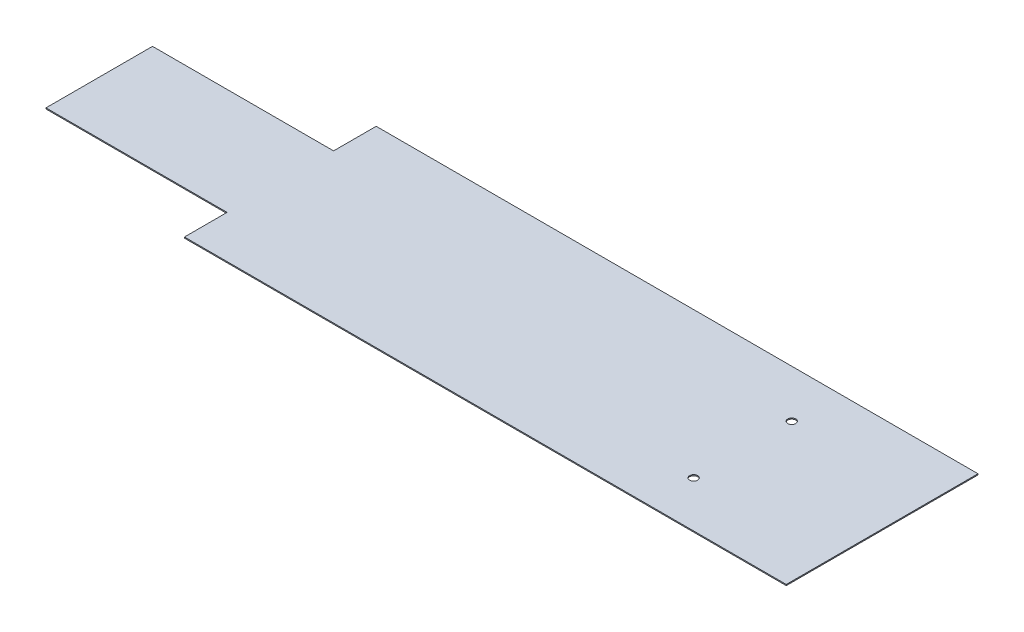
ISO-10303-21;
HEADER;
FILE_DESCRIPTION(('STEP AP214'),'2;1');
FILE_NAME('part.step','',(''),(''),'','','');
FILE_SCHEMA(('AUTOMOTIVE_DESIGN { 1 0 10303 214 1 1 1 1 }'));
ENDSEC;
DATA;
#1=APPLICATION_CONTEXT('core data for automotive mechanical design processes');
#2=APPLICATION_PROTOCOL_DEFINITION('international standard','automotive_design',2000,#1);
#3=PRODUCT_CONTEXT('',#1,'mechanical');
#4=PRODUCT('Part','Part','',(#3));
#5=PRODUCT_RELATED_PRODUCT_CATEGORY('part','',(#4));
#6=PRODUCT_DEFINITION_FORMATION('','',#4);
#7=PRODUCT_DEFINITION_CONTEXT('part definition',#1,'design');
#8=PRODUCT_DEFINITION('design','',#6,#7);
#9=PRODUCT_DEFINITION_SHAPE('','',#8);
#10=(LENGTH_UNIT() NAMED_UNIT(*) SI_UNIT(.MILLI.,.METRE.));
#11=(NAMED_UNIT(*) PLANE_ANGLE_UNIT() SI_UNIT($,.RADIAN.));
#12=(NAMED_UNIT(*) SI_UNIT($,.STERADIAN.) SOLID_ANGLE_UNIT());
#13=UNCERTAINTY_MEASURE_WITH_UNIT(LENGTH_MEASURE(1.E-05),#10,'distance_accuracy_value','');
#14=(GEOMETRIC_REPRESENTATION_CONTEXT(3) GLOBAL_UNCERTAINTY_ASSIGNED_CONTEXT((#13)) GLOBAL_UNIT_ASSIGNED_CONTEXT((#10,
#11,#12)) REPRESENTATION_CONTEXT('',''));
#15=CARTESIAN_POINT('',(0.,0.,0.));
#16=DIRECTION('',(0.,0.,1.));
#17=DIRECTION('',(1.,0.,0.));
#18=AXIS2_PLACEMENT_3D('',#15,#16,#17);
#19=CARTESIAN_POINT('',(377.059739774095,2.,-216.784759358289));
#20=DIRECTION('',(-1.,0.,0.));
#21=DIRECTION('',(0.,0.,1.));
#22=AXIS2_PLACEMENT_3D('',#19,#20,#21);
#23=PLANE('',#22);
#24=DIRECTION('',(0.,0.,-1.));
#25=VECTOR('',#24,1.);
#26=CARTESIAN_POINT('',(377.059739774095,0.,-216.784759358289));
#27=LINE('',#26,#25);
#28=CARTESIAN_POINT('',(377.059739774095,0.,143.215240641711));
#29=VERTEX_POINT('',#28);
#30=CARTESIAN_POINT('',(377.059739774095,0.,-216.784759358289));
#31=VERTEX_POINT('',#30);
#32=EDGE_CURVE('E140',#29,#31,#27,.T.);
#33=ORIENTED_EDGE('',*,*,#32,.T.);
#34=DIRECTION('',(0.,-1.,0.));
#35=VECTOR('',#34,1.);
#36=CARTESIAN_POINT('',(377.059739774095,2.,-216.784759358289));
#37=LINE('',#36,#35);
#38=CARTESIAN_POINT('',(377.059739774095,2.,-216.784759358289));
#39=VERTEX_POINT('',#38);
#40=EDGE_CURVE('E11',#39,#31,#37,.T.);
#41=ORIENTED_EDGE('',*,*,#40,.F.);
#42=DIRECTION('',(0.,0.,-1.));
#43=VECTOR('',#42,1.);
#44=CARTESIAN_POINT('',(377.059739774095,2.,-216.784759358289));
#45=LINE('',#44,#43);
#46=CARTESIAN_POINT('',(377.059739774095,2.,143.215240641711));
#47=VERTEX_POINT('',#46);
#48=EDGE_CURVE('E163',#47,#39,#45,.T.);
#49=ORIENTED_EDGE('',*,*,#48,.F.);
#50=DIRECTION('',(0.,-1.,0.));
#51=VECTOR('',#50,1.);
#52=CARTESIAN_POINT('',(377.059739774095,2.,143.215240641711));
#53=LINE('',#52,#51);
#54=EDGE_CURVE('E136',#47,#29,#53,.T.);
#55=ORIENTED_EDGE('',*,*,#54,.T.);
#56=EDGE_LOOP('',(#33,#41,#49,#55));
#57=FACE_BOUND('',#56,.T.);
#58=ADVANCED_FACE('F39',(#57),#23,.F.);
#59=CARTESIAN_POINT('',(377.059739774095,2.,-216.784759358289));
#60=DIRECTION('',(0.,0.,1.));
#61=DIRECTION('',(1.,0.,0.));
#62=AXIS2_PLACEMENT_3D('',#59,#60,#61);
#63=PLANE('',#62);
#64=DIRECTION('',(-1.,0.,0.));
#65=VECTOR('',#64,1.);
#66=CARTESIAN_POINT('',(377.059739774095,0.,-216.784759358289));
#67=LINE('',#66,#65);
#68=CARTESIAN_POINT('',(-752.940260225905,0.,-216.784759358289));
#69=VERTEX_POINT('',#68);
#70=EDGE_CURVE('E144',#31,#69,#67,.T.);
#71=ORIENTED_EDGE('',*,*,#70,.T.);
#72=DIRECTION('',(0.,-1.,0.));
#73=VECTOR('',#72,1.);
#74=CARTESIAN_POINT('',(-752.940260225905,2.,-216.784759358289));
#75=LINE('',#74,#73);
#76=CARTESIAN_POINT('',(-752.940260225905,2.,-216.784759358289));
#77=VERTEX_POINT('',#76);
#78=EDGE_CURVE('E48',#77,#69,#75,.T.);
#79=ORIENTED_EDGE('',*,*,#78,.F.);
#80=DIRECTION('',(-1.,0.,0.));
#81=VECTOR('',#80,1.);
#82=CARTESIAN_POINT('',(377.059739774095,2.,-216.784759358289));
#83=LINE('',#82,#81);
#84=EDGE_CURVE('E99',#39,#77,#83,.T.);
#85=ORIENTED_EDGE('',*,*,#84,.F.);
#86=ORIENTED_EDGE('',*,*,#40,.T.);
#87=EDGE_LOOP('',(#71,#79,#85,#86));
#88=FACE_BOUND('',#87,.T.);
#89=ADVANCED_FACE('F247',(#88),#63,.F.);
#90=CARTESIAN_POINT('',(-752.940260225905,2.,-216.784759358289));
#91=DIRECTION('',(1.,0.,0.));
#92=DIRECTION('',(0.,0.,-1.));
#93=AXIS2_PLACEMENT_3D('',#90,#91,#92);
#94=PLANE('',#93);
#95=DIRECTION('',(0.,0.,1.));
#96=VECTOR('',#95,1.);
#97=CARTESIAN_POINT('',(-752.940260225905,0.,-216.784759358289));
#98=LINE('',#97,#96);
#99=CARTESIAN_POINT('',(-752.940260225905,0.,-136.784759358289));
#100=VERTEX_POINT('',#99);
#101=EDGE_CURVE('E148',#69,#100,#98,.T.);
#102=ORIENTED_EDGE('',*,*,#101,.T.);
#103=DIRECTION('',(0.,-1.,0.));
#104=VECTOR('',#103,1.);
#105=CARTESIAN_POINT('',(-752.940260225905,2.,-136.784759358289));
#106=LINE('',#105,#104);
#107=CARTESIAN_POINT('',(-752.940260225905,2.,-136.784759358289));
#108=VERTEX_POINT('',#107);
#109=EDGE_CURVE('E174',#108,#100,#106,.T.);
#110=ORIENTED_EDGE('',*,*,#109,.F.);
#111=DIRECTION('',(0.,0.,1.));
#112=VECTOR('',#111,1.);
#113=CARTESIAN_POINT('',(-752.940260225905,2.,-216.784759358289));
#114=LINE('',#113,#112);
#115=EDGE_CURVE('E184',#77,#108,#114,.T.);
#116=ORIENTED_EDGE('',*,*,#115,.F.);
#117=ORIENTED_EDGE('',*,*,#78,.T.);
#118=EDGE_LOOP('',(#102,#110,#116,#117));
#119=FACE_BOUND('',#118,.T.);
#120=ADVANCED_FACE('F182',(#119),#94,.F.);
#121=CARTESIAN_POINT('',(-752.940260225905,2.,-136.784759358289));
#122=DIRECTION('',(0.,0.,1.));
#123=DIRECTION('',(1.,0.,0.));
#124=AXIS2_PLACEMENT_3D('',#121,#122,#123);
#125=PLANE('',#124);
#126=DIRECTION('',(-1.,0.,0.));
#127=VECTOR('',#126,1.);
#128=CARTESIAN_POINT('',(-752.940260225905,0.,-136.784759358289));
#129=LINE('',#128,#127);
#130=CARTESIAN_POINT('',(-1092.9402602259,0.,-136.784759358289));
#131=VERTEX_POINT('',#130);
#132=EDGE_CURVE('E151',#100,#131,#129,.T.);
#133=ORIENTED_EDGE('',*,*,#132,.T.);
#134=DIRECTION('',(0.,-1.,0.));
#135=VECTOR('',#134,1.);
#136=CARTESIAN_POINT('',(-1092.9402602259,2.,-136.784759358289));
#137=LINE('',#136,#135);
#138=CARTESIAN_POINT('',(-1092.9402602259,2.,-136.784759358289));
#139=VERTEX_POINT('',#138);
#140=EDGE_CURVE('E170',#139,#131,#137,.T.);
#141=ORIENTED_EDGE('',*,*,#140,.F.);
#142=DIRECTION('',(-1.,0.,0.));
#143=VECTOR('',#142,1.);
#144=CARTESIAN_POINT('',(-752.940260225905,2.,-136.784759358289));
#145=LINE('',#144,#143);
#146=EDGE_CURVE('E197',#108,#139,#145,.T.);
#147=ORIENTED_EDGE('',*,*,#146,.F.);
#148=ORIENTED_EDGE('',*,*,#109,.T.);
#149=EDGE_LOOP('',(#133,#141,#147,#148));
#150=FACE_BOUND('',#149,.T.);
#151=ADVANCED_FACE('F192',(#150),#125,.F.);
#152=CARTESIAN_POINT('',(-1092.9402602259,2.,-136.784759358289));
#153=DIRECTION('',(1.,0.,0.));
#154=DIRECTION('',(0.,0.,-1.));
#155=AXIS2_PLACEMENT_3D('',#152,#153,#154);
#156=PLANE('',#155);
#157=DIRECTION('',(0.,0.,1.));
#158=VECTOR('',#157,1.);
#159=CARTESIAN_POINT('',(-1092.9402602259,0.,-136.784759358289));
#160=LINE('',#159,#158);
#161=CARTESIAN_POINT('',(-1092.9402602259,0.,63.2152406417113));
#162=VERTEX_POINT('',#161);
#163=EDGE_CURVE('E154',#131,#162,#160,.T.);
#164=ORIENTED_EDGE('',*,*,#163,.T.);
#165=DIRECTION('',(0.,-1.,0.));
#166=VECTOR('',#165,1.);
#167=CARTESIAN_POINT('',(-1092.9402602259,2.,63.2152406417113));
#168=LINE('',#167,#166);
#169=CARTESIAN_POINT('',(-1092.9402602259,2.,63.2152406417113));
#170=VERTEX_POINT('',#169);
#171=EDGE_CURVE('E129',#170,#162,#168,.T.);
#172=ORIENTED_EDGE('',*,*,#171,.F.);
#173=DIRECTION('',(0.,0.,1.));
#174=VECTOR('',#173,1.);
#175=CARTESIAN_POINT('',(-1092.9402602259,2.,-136.784759358289));
#176=LINE('',#175,#174);
#177=EDGE_CURVE('E118',#139,#170,#176,.T.);
#178=ORIENTED_EDGE('',*,*,#177,.F.);
#179=ORIENTED_EDGE('',*,*,#140,.T.);
#180=EDGE_LOOP('',(#164,#172,#178,#179));
#181=FACE_BOUND('',#180,.T.);
#182=ADVANCED_FACE('F195',(#181),#156,.F.);
#183=CARTESIAN_POINT('',(-752.940260225905,2.,63.2152406417112));
#184=DIRECTION('',(0.,0.,-1.));
#185=DIRECTION('',(-1.,0.,0.));
#186=AXIS2_PLACEMENT_3D('',#183,#184,#185);
#187=PLANE('',#186);
#188=DIRECTION('',(1.,0.,0.));
#189=VECTOR('',#188,1.);
#190=CARTESIAN_POINT('',(-752.940260225905,0.,63.2152406417112));
#191=LINE('',#190,#189);
#192=CARTESIAN_POINT('',(-752.940260225905,0.,63.2152406417112));
#193=VERTEX_POINT('',#192);
#194=EDGE_CURVE('E127',#162,#193,#191,.T.);
#195=ORIENTED_EDGE('',*,*,#194,.T.);
#196=DIRECTION('',(0.,-1.,0.));
#197=VECTOR('',#196,1.);
#198=CARTESIAN_POINT('',(-752.940260225905,2.,63.2152406417112));
#199=LINE('',#198,#197);
#200=CARTESIAN_POINT('',(-752.940260225905,2.,63.2152406417112));
#201=VERTEX_POINT('',#200);
#202=EDGE_CURVE('E124',#201,#193,#199,.T.);
#203=ORIENTED_EDGE('',*,*,#202,.F.);
#204=DIRECTION('',(1.,0.,0.));
#205=VECTOR('',#204,1.);
#206=CARTESIAN_POINT('',(-752.940260225905,2.,63.2152406417112));
#207=LINE('',#206,#205);
#208=EDGE_CURVE('E112',#170,#201,#207,.T.);
#209=ORIENTED_EDGE('',*,*,#208,.F.);
#210=ORIENTED_EDGE('',*,*,#171,.T.);
#211=EDGE_LOOP('',(#195,#203,#209,#210));
#212=FACE_BOUND('',#211,.T.);
#213=ADVANCED_FACE('F125',(#212),#187,.F.);
#214=CARTESIAN_POINT('',(-752.940260225905,2.,63.2152406417112));
#215=DIRECTION('',(1.,0.,0.));
#216=DIRECTION('',(0.,0.,-1.));
#217=AXIS2_PLACEMENT_3D('',#214,#215,#216);
#218=PLANE('',#217);
#219=DIRECTION('',(0.,0.,1.));
#220=VECTOR('',#219,1.);
#221=CARTESIAN_POINT('',(-752.940260225905,0.,63.2152406417112));
#222=LINE('',#221,#220);
#223=CARTESIAN_POINT('',(-752.940260225905,0.,143.215240641711));
#224=VERTEX_POINT('',#223);
#225=EDGE_CURVE('E85',#193,#224,#222,.T.);
#226=ORIENTED_EDGE('',*,*,#225,.T.);
#227=DIRECTION('',(0.,-1.,0.));
#228=VECTOR('',#227,1.);
#229=CARTESIAN_POINT('',(-752.940260225905,2.,143.215240641711));
#230=LINE('',#229,#228);
#231=CARTESIAN_POINT('',(-752.940260225905,2.,143.215240641711));
#232=VERTEX_POINT('',#231);
#233=EDGE_CURVE('E130',#232,#224,#230,.T.);
#234=ORIENTED_EDGE('',*,*,#233,.F.);
#235=DIRECTION('',(0.,0.,1.));
#236=VECTOR('',#235,1.);
#237=CARTESIAN_POINT('',(-752.940260225905,2.,63.2152406417112));
#238=LINE('',#237,#236);
#239=EDGE_CURVE('E116',#201,#232,#238,.T.);
#240=ORIENTED_EDGE('',*,*,#239,.F.);
#241=ORIENTED_EDGE('',*,*,#202,.T.);
#242=EDGE_LOOP('',(#226,#234,#240,#241));
#243=FACE_BOUND('',#242,.T.);
#244=ADVANCED_FACE('F132',(#243),#218,.F.);
#245=CARTESIAN_POINT('',(377.059739774095,2.,143.215240641711));
#246=DIRECTION('',(0.,0.,-1.));
#247=DIRECTION('',(-1.,0.,0.));
#248=AXIS2_PLACEMENT_3D('',#245,#246,#247);
#249=PLANE('',#248);
#250=DIRECTION('',(1.,0.,0.));
#251=VECTOR('',#250,1.);
#252=CARTESIAN_POINT('',(377.059739774095,0.,143.215240641711));
#253=LINE('',#252,#251);
#254=EDGE_CURVE('E91',#224,#29,#253,.T.);
#255=ORIENTED_EDGE('',*,*,#254,.T.);
#256=ORIENTED_EDGE('',*,*,#54,.F.);
#257=DIRECTION('',(1.,0.,0.));
#258=VECTOR('',#257,1.);
#259=CARTESIAN_POINT('',(377.059739774095,2.,143.215240641711));
#260=LINE('',#259,#258);
#261=EDGE_CURVE('E56',#232,#47,#260,.T.);
#262=ORIENTED_EDGE('',*,*,#261,.F.);
#263=ORIENTED_EDGE('',*,*,#233,.T.);
#264=EDGE_LOOP('',(#255,#256,#262,#263));
#265=FACE_BOUND('',#264,.T.);
#266=ADVANCED_FACE('F234',(#265),#249,.F.);
#267=CARTESIAN_POINT('',(0.,2.,0.));
#268=DIRECTION('',(0.,-1.,0.));
#269=DIRECTION('',(0.,0.,-1.));
#270=AXIS2_PLACEMENT_3D('',#267,#268,#269);
#271=PLANE('',#270);
#272=CARTESIAN_POINT('',(116.805980261571,2.,-127.3501484575));
#273=DIRECTION('',(0.,1.,0.));
#274=DIRECTION('',(0.,0.,1.));
#275=AXIS2_PLACEMENT_3D('',#272,#273,#274);
#276=CIRCLE('',#275,7.50000000000001);
#277=CARTESIAN_POINT('',(116.805980261571,2.,-119.8501484575));
#278=VERTEX_POINT('',#277);
#279=EDGE_CURVE('E215',#278,#278,#276,.T.);
#280=ORIENTED_EDGE('',*,*,#279,.F.);
#281=EDGE_LOOP('',(#280));
#282=FACE_BOUND('',#281,.T.);
#283=CARTESIAN_POINT('',(116.805980261571,2.,56.8840271655948));
#284=DIRECTION('',(0.,1.,0.));
#285=DIRECTION('',(0.,0.,1.));
#286=AXIS2_PLACEMENT_3D('',#283,#284,#285);
#287=CIRCLE('',#286,7.50000000000001);
#288=CARTESIAN_POINT('',(116.805980261571,2.,64.3840271655949));
#289=VERTEX_POINT('',#288);
#290=EDGE_CURVE('E207',#289,#289,#287,.T.);
#291=ORIENTED_EDGE('',*,*,#290,.F.);
#292=EDGE_LOOP('',(#291));
#293=FACE_BOUND('',#292,.T.);
#294=ORIENTED_EDGE('',*,*,#48,.T.);
#295=ORIENTED_EDGE('',*,*,#84,.T.);
#296=ORIENTED_EDGE('',*,*,#115,.T.);
#297=ORIENTED_EDGE('',*,*,#146,.T.);
#298=ORIENTED_EDGE('',*,*,#177,.T.);
#299=ORIENTED_EDGE('',*,*,#208,.T.);
#300=ORIENTED_EDGE('',*,*,#239,.T.);
#301=ORIENTED_EDGE('',*,*,#261,.T.);
#302=EDGE_LOOP('',(#294,#295,#296,#297,#298,#299,#300,#301));
#303=FACE_BOUND('',#302,.T.);
#304=ADVANCED_FACE('F114',(#282,#293,#303),#271,.F.);
#305=CARTESIAN_POINT('',(0.,0.,0.));
#306=DIRECTION('',(0.,-1.,0.));
#307=DIRECTION('',(0.,0.,-1.));
#308=AXIS2_PLACEMENT_3D('',#305,#306,#307);
#309=PLANE('',#308);
#310=CARTESIAN_POINT('',(116.805980261571,0.,-127.3501484575));
#311=DIRECTION('',(0.,1.,0.));
#312=DIRECTION('',(0.,0.,1.));
#313=AXIS2_PLACEMENT_3D('',#310,#311,#312);
#314=CIRCLE('',#313,7.50000000000001);
#315=CARTESIAN_POINT('',(116.805980261571,0.,-119.8501484575));
#316=VERTEX_POINT('',#315);
#317=EDGE_CURVE('E145',#316,#316,#314,.T.);
#318=ORIENTED_EDGE('',*,*,#317,.T.);
#319=EDGE_LOOP('',(#318));
#320=FACE_BOUND('',#319,.T.);
#321=CARTESIAN_POINT('',(116.805980261571,0.,56.8840271655948));
#322=DIRECTION('',(0.,1.,0.));
#323=DIRECTION('',(0.,0.,1.));
#324=AXIS2_PLACEMENT_3D('',#321,#322,#323);
#325=CIRCLE('',#324,7.50000000000001);
#326=CARTESIAN_POINT('',(116.805980261571,0.,64.3840271655949));
#327=VERTEX_POINT('',#326);
#328=EDGE_CURVE('E211',#327,#327,#325,.T.);
#329=ORIENTED_EDGE('',*,*,#328,.T.);
#330=EDGE_LOOP('',(#329));
#331=FACE_BOUND('',#330,.T.);
#332=ORIENTED_EDGE('',*,*,#32,.F.);
#333=ORIENTED_EDGE('',*,*,#254,.F.);
#334=ORIENTED_EDGE('',*,*,#225,.F.);
#335=ORIENTED_EDGE('',*,*,#194,.F.);
#336=ORIENTED_EDGE('',*,*,#163,.F.);
#337=ORIENTED_EDGE('',*,*,#132,.F.);
#338=ORIENTED_EDGE('',*,*,#101,.F.);
#339=ORIENTED_EDGE('',*,*,#70,.F.);
#340=EDGE_LOOP('',(#332,#333,#334,#335,#336,#337,#338,#339));
#341=FACE_BOUND('',#340,.T.);
#342=ADVANCED_FACE('F188',(#320,#331,#341),#309,.T.);
#343=CARTESIAN_POINT('',(116.805980261571,0.,56.8840271655948));
#344=DIRECTION('',(0.,1.,0.));
#345=DIRECTION('',(0.,0.,1.));
#346=AXIS2_PLACEMENT_3D('',#343,#344,#345);
#347=CYLINDRICAL_SURFACE('',#346,7.50000000000001);
#348=ORIENTED_EDGE('',*,*,#328,.F.);
#349=EDGE_LOOP('',(#348));
#350=FACE_BOUND('',#349,.T.);
#351=ORIENTED_EDGE('',*,*,#290,.T.);
#352=EDGE_LOOP('',(#351));
#353=FACE_BOUND('',#352,.T.);
#354=ADVANCED_FACE('F228',(#350,#353),#347,.F.);
#355=CARTESIAN_POINT('',(116.805980261571,0.,-127.3501484575));
#356=DIRECTION('',(0.,1.,0.));
#357=DIRECTION('',(0.,0.,1.));
#358=AXIS2_PLACEMENT_3D('',#355,#356,#357);
#359=CYLINDRICAL_SURFACE('',#358,7.50000000000001);
#360=ORIENTED_EDGE('',*,*,#317,.F.);
#361=EDGE_LOOP('',(#360));
#362=FACE_BOUND('',#361,.T.);
#363=ORIENTED_EDGE('',*,*,#279,.T.);
#364=EDGE_LOOP('',(#363));
#365=FACE_BOUND('',#364,.T.);
#366=ADVANCED_FACE('F225',(#362,#365),#359,.F.);
#367=CLOSED_SHELL('',(#58,#89,#120,#151,#182,#213,#244,#266,#304,#342,#354,#366));
#368=MANIFOLD_SOLID_BREP('B2',#367);
#369=ADVANCED_BREP_SHAPE_REPRESENTATION('',(#18,#368),#14);
#370=SHAPE_DEFINITION_REPRESENTATION(#9,#369);
ENDSEC;
END-ISO-10303-21;
